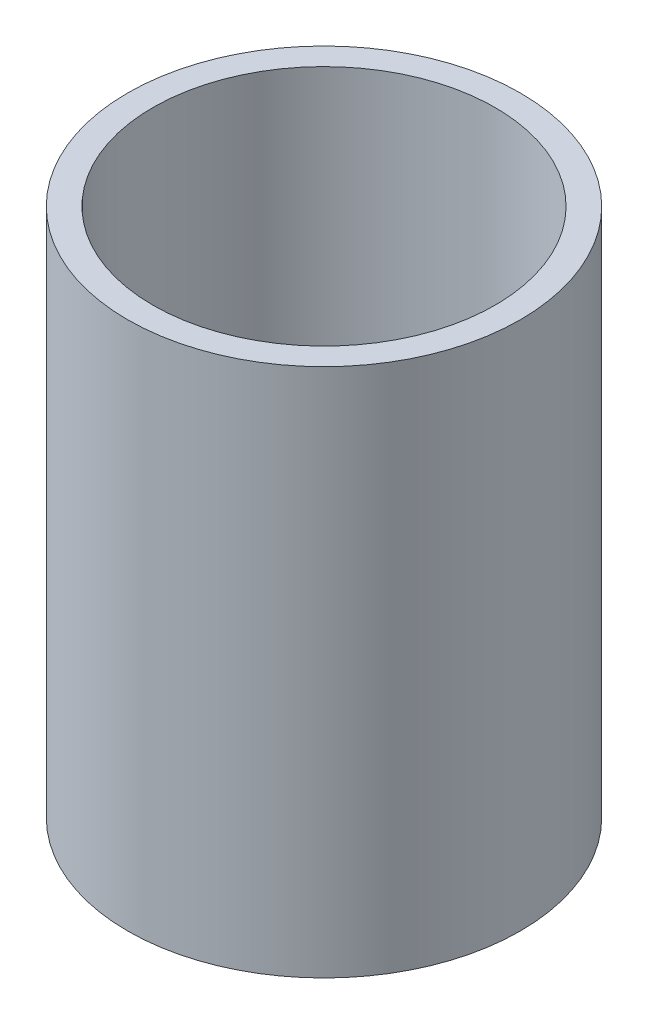
ISO-10303-21;
HEADER;
FILE_DESCRIPTION(('STEP AP214'),'2;1');
FILE_NAME('part.step','',(''),(''),'','','');
FILE_SCHEMA(('AUTOMOTIVE_DESIGN { 1 0 10303 214 1 1 1 1 }'));
ENDSEC;
DATA;
#1=APPLICATION_CONTEXT('core data for automotive mechanical design processes');
#2=APPLICATION_PROTOCOL_DEFINITION('international standard','automotive_design',2000,#1);
#3=PRODUCT_CONTEXT('',#1,'mechanical');
#4=PRODUCT('Part','Part','',(#3));
#5=PRODUCT_RELATED_PRODUCT_CATEGORY('part','',(#4));
#6=PRODUCT_DEFINITION_FORMATION('','',#4);
#7=PRODUCT_DEFINITION_CONTEXT('part definition',#1,'design');
#8=PRODUCT_DEFINITION('design','',#6,#7);
#9=PRODUCT_DEFINITION_SHAPE('','',#8);
#10=(LENGTH_UNIT() NAMED_UNIT(*) SI_UNIT(.MILLI.,.METRE.));
#11=(NAMED_UNIT(*) PLANE_ANGLE_UNIT() SI_UNIT($,.RADIAN.));
#12=(NAMED_UNIT(*) SI_UNIT($,.STERADIAN.) SOLID_ANGLE_UNIT());
#13=UNCERTAINTY_MEASURE_WITH_UNIT(LENGTH_MEASURE(1.E-05),#10,'distance_accuracy_value','');
#14=(GEOMETRIC_REPRESENTATION_CONTEXT(3) GLOBAL_UNCERTAINTY_ASSIGNED_CONTEXT((#13)) GLOBAL_UNIT_ASSIGNED_CONTEXT((#10,
#11,#12)) REPRESENTATION_CONTEXT('',''));
#15=CARTESIAN_POINT('',(0.,0.,0.));
#16=DIRECTION('',(0.,0.,1.));
#17=DIRECTION('',(1.,0.,0.));
#18=AXIS2_PLACEMENT_3D('',#15,#16,#17);
#19=CARTESIAN_POINT('',(0.,55.,0.));
#20=DIRECTION('',(0.,1.,0.));
#21=DIRECTION('',(0.,0.,1.));
#22=AXIS2_PLACEMENT_3D('',#19,#20,#21);
#23=CYLINDRICAL_SURFACE('',#22,49.4665);
#24=CARTESIAN_POINT('',(0.,-87.732365567385,0.));
#25=DIRECTION('',(0.,1.,0.));
#26=DIRECTION('',(0.,0.,1.));
#27=AXIS2_PLACEMENT_3D('',#24,#25,#26);
#28=CIRCLE('',#27,49.4665);
#29=CARTESIAN_POINT('',(0.,-87.732365567385,49.4665));
#30=VERTEX_POINT('',#29);
#31=EDGE_CURVE('E12',#30,#30,#28,.T.);
#32=ORIENTED_EDGE('',*,*,#31,.T.);
#33=EDGE_LOOP('',(#32));
#34=FACE_BOUND('',#33,.T.);
#35=CARTESIAN_POINT('',(0.,45.6176344326149,0.));
#36=DIRECTION('',(0.,1.,0.));
#37=DIRECTION('',(0.,0.,1.));
#38=AXIS2_PLACEMENT_3D('',#35,#36,#37);
#39=CIRCLE('',#38,49.4665);
#40=CARTESIAN_POINT('',(0.,45.6176344326149,49.4665));
#41=VERTEX_POINT('',#40);
#42=EDGE_CURVE('E55',#41,#41,#39,.T.);
#43=ORIENTED_EDGE('',*,*,#42,.F.);
#44=EDGE_LOOP('',(#43));
#45=FACE_BOUND('',#44,.T.);
#46=ADVANCED_FACE('F41',(#34,#45),#23,.T.);
#47=CARTESIAN_POINT('',(-49.4665,-87.7323655673851,0.));
#48=DIRECTION('',(0.,-1.,0.));
#49=DIRECTION('',(0.,0.,-1.));
#50=AXIS2_PLACEMENT_3D('',#47,#48,#49);
#51=PLANE('',#50);
#52=CARTESIAN_POINT('',(0.,-87.732365567385,0.));
#53=DIRECTION('',(0.,1.,0.));
#54=DIRECTION('',(0.,0.,1.));
#55=AXIS2_PLACEMENT_3D('',#52,#53,#54);
#56=CIRCLE('',#55,43.1165);
#57=CARTESIAN_POINT('',(0.,-87.732365567385,43.1165));
#58=VERTEX_POINT('',#57);
#59=EDGE_CURVE('E47',#58,#58,#56,.T.);
#60=ORIENTED_EDGE('',*,*,#59,.T.);
#61=EDGE_LOOP('',(#60));
#62=FACE_BOUND('',#61,.T.);
#63=ORIENTED_EDGE('',*,*,#31,.F.);
#64=EDGE_LOOP('',(#63));
#65=FACE_BOUND('',#64,.T.);
#66=ADVANCED_FACE('F65',(#62,#65),#51,.T.);
#67=CARTESIAN_POINT('',(0.,55.,0.));
#68=DIRECTION('',(0.,1.,0.));
#69=DIRECTION('',(0.,0.,1.));
#70=AXIS2_PLACEMENT_3D('',#67,#68,#69);
#71=CYLINDRICAL_SURFACE('',#70,43.1165);
#72=CARTESIAN_POINT('',(0.,45.6176344326149,0.));
#73=DIRECTION('',(0.,1.,0.));
#74=DIRECTION('',(0.,0.,1.));
#75=AXIS2_PLACEMENT_3D('',#72,#73,#74);
#76=CIRCLE('',#75,43.1165);
#77=CARTESIAN_POINT('',(0.,45.6176344326149,43.1165));
#78=VERTEX_POINT('',#77);
#79=EDGE_CURVE('E51',#78,#78,#76,.T.);
#80=ORIENTED_EDGE('',*,*,#79,.T.);
#81=EDGE_LOOP('',(#80));
#82=FACE_BOUND('',#81,.T.);
#83=ORIENTED_EDGE('',*,*,#59,.F.);
#84=EDGE_LOOP('',(#83));
#85=FACE_BOUND('',#84,.T.);
#86=ADVANCED_FACE('F69',(#82,#85),#71,.F.);
#87=CARTESIAN_POINT('',(-49.4665,45.6176344326149,0.));
#88=DIRECTION('',(0.,1.,0.));
#89=DIRECTION('',(0.,0.,1.));
#90=AXIS2_PLACEMENT_3D('',#87,#88,#89);
#91=PLANE('',#90);
#92=ORIENTED_EDGE('',*,*,#42,.T.);
#93=EDGE_LOOP('',(#92));
#94=FACE_BOUND('',#93,.T.);
#95=ORIENTED_EDGE('',*,*,#79,.F.);
#96=EDGE_LOOP('',(#95));
#97=FACE_BOUND('',#96,.T.);
#98=ADVANCED_FACE('F61',(#94,#97),#91,.T.);
#99=CLOSED_SHELL('',(#46,#66,#86,#98));
#100=MANIFOLD_SOLID_BREP('B2',#99);
#101=ADVANCED_BREP_SHAPE_REPRESENTATION('',(#18,#100),#14);
#102=SHAPE_DEFINITION_REPRESENTATION(#9,#101);
ENDSEC;
END-ISO-10303-21;
